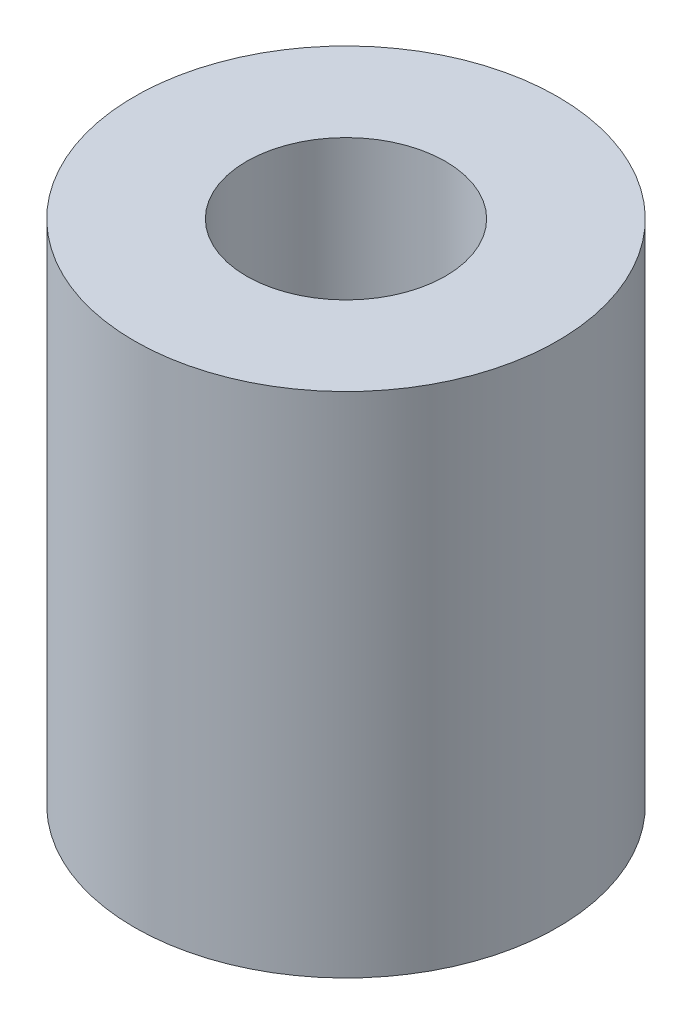
ISO-10303-21;
HEADER;
FILE_DESCRIPTION(('STEP AP214'),'2;1');
FILE_NAME('part.step','',(''),(''),'','','');
FILE_SCHEMA(('AUTOMOTIVE_DESIGN { 1 0 10303 214 1 1 1 1 }'));
ENDSEC;
DATA;
#1=APPLICATION_CONTEXT('core data for automotive mechanical design processes');
#2=APPLICATION_PROTOCOL_DEFINITION('international standard','automotive_design',2000,#1);
#3=PRODUCT_CONTEXT('',#1,'mechanical');
#4=PRODUCT('Part','Part','',(#3));
#5=PRODUCT_RELATED_PRODUCT_CATEGORY('part','',(#4));
#6=PRODUCT_DEFINITION_FORMATION('','',#4);
#7=PRODUCT_DEFINITION_CONTEXT('part definition',#1,'design');
#8=PRODUCT_DEFINITION('design','',#6,#7);
#9=PRODUCT_DEFINITION_SHAPE('','',#8);
#10=(LENGTH_UNIT() NAMED_UNIT(*) SI_UNIT(.MILLI.,.METRE.));
#11=(NAMED_UNIT(*) PLANE_ANGLE_UNIT() SI_UNIT($,.RADIAN.));
#12=(NAMED_UNIT(*) SI_UNIT($,.STERADIAN.) SOLID_ANGLE_UNIT());
#13=UNCERTAINTY_MEASURE_WITH_UNIT(LENGTH_MEASURE(1.E-05),#10,'distance_accuracy_value','');
#14=(GEOMETRIC_REPRESENTATION_CONTEXT(3) GLOBAL_UNCERTAINTY_ASSIGNED_CONTEXT((#13)) GLOBAL_UNIT_ASSIGNED_CONTEXT((#10,
#11,#12)) REPRESENTATION_CONTEXT('',''));
#15=CARTESIAN_POINT('',(0.,0.,0.));
#16=DIRECTION('',(0.,0.,1.));
#17=DIRECTION('',(1.,0.,0.));
#18=AXIS2_PLACEMENT_3D('',#15,#16,#17);
#19=CARTESIAN_POINT('',(0.,0.,0.));
#20=DIRECTION('',(0.,1.,0.));
#21=DIRECTION('',(0.,0.,1.));
#22=AXIS2_PLACEMENT_3D('',#19,#20,#21);
#23=PLANE('',#22);
#24=CARTESIAN_POINT('',(0.,0.,0.));
#25=DIRECTION('',(0.,1.,0.));
#26=DIRECTION('',(0.,0.,1.));
#27=AXIS2_PLACEMENT_3D('',#24,#25,#26);
#28=CIRCLE('',#27,5.);
#29=CARTESIAN_POINT('',(0.,0.,5.));
#30=VERTEX_POINT('',#29);
#31=EDGE_CURVE('E64',#30,#30,#28,.T.);
#32=ORIENTED_EDGE('',*,*,#31,.F.);
#33=EDGE_LOOP('',(#32));
#34=FACE_BOUND('',#33,.T.);
#35=ADVANCED_FACE('F60',(#34),#23,.F.);
#36=CARTESIAN_POINT('',(0.,12.,0.));
#37=DIRECTION('',(0.,-1.,0.));
#38=DIRECTION('',(0.,0.,-1.));
#39=AXIS2_PLACEMENT_3D('',#36,#37,#38);
#40=CYLINDRICAL_SURFACE('',#39,5.);
#41=CARTESIAN_POINT('',(0.,12.,0.));
#42=DIRECTION('',(0.,1.,0.));
#43=DIRECTION('',(0.,0.,1.));
#44=AXIS2_PLACEMENT_3D('',#41,#42,#43);
#45=CIRCLE('',#44,5.);
#46=CARTESIAN_POINT('',(0.,12.,5.));
#47=VERTEX_POINT('',#46);
#48=EDGE_CURVE('E11',#47,#47,#45,.T.);
#49=ORIENTED_EDGE('',*,*,#48,.F.);
#50=EDGE_LOOP('',(#49));
#51=FACE_BOUND('',#50,.T.);
#52=ORIENTED_EDGE('',*,*,#31,.T.);
#53=EDGE_LOOP('',(#52));
#54=FACE_BOUND('',#53,.T.);
#55=ADVANCED_FACE('F62',(#51,#54),#40,.T.);
#56=CARTESIAN_POINT('',(0.,12.,0.));
#57=DIRECTION('',(0.,1.,0.));
#58=DIRECTION('',(0.,0.,1.));
#59=AXIS2_PLACEMENT_3D('',#56,#57,#58);
#60=PLANE('',#59);
#61=CARTESIAN_POINT('',(0.,12.,0.));
#62=DIRECTION('',(0.,1.,0.));
#63=DIRECTION('',(0.,0.,1.));
#64=AXIS2_PLACEMENT_3D('',#61,#62,#63);
#65=CIRCLE('',#64,2.35);
#66=CARTESIAN_POINT('',(0.,12.,2.35));
#67=VERTEX_POINT('',#66);
#68=EDGE_CURVE('E73',#67,#67,#65,.T.);
#69=ORIENTED_EDGE('',*,*,#68,.F.);
#70=EDGE_LOOP('',(#69));
#71=FACE_BOUND('',#70,.T.);
#72=ORIENTED_EDGE('',*,*,#48,.T.);
#73=EDGE_LOOP('',(#72));
#74=FACE_BOUND('',#73,.T.);
#75=ADVANCED_FACE('F84',(#71,#74),#60,.T.);
#76=CARTESIAN_POINT('',(0.,3.,0.));
#77=DIRECTION('',(0.,1.,0.));
#78=DIRECTION('',(0.,0.,1.));
#79=AXIS2_PLACEMENT_3D('',#76,#77,#78);
#80=CYLINDRICAL_SURFACE('',#79,2.35);
#81=CARTESIAN_POINT('',(0.,3.,0.));
#82=DIRECTION('',(0.,1.,0.));
#83=DIRECTION('',(0.,0.,1.));
#84=AXIS2_PLACEMENT_3D('',#81,#82,#83);
#85=CIRCLE('',#84,2.35);
#86=CARTESIAN_POINT('',(0.,3.,2.35));
#87=VERTEX_POINT('',#86);
#88=EDGE_CURVE('E71',#87,#87,#85,.T.);
#89=ORIENTED_EDGE('',*,*,#88,.F.);
#90=EDGE_LOOP('',(#89));
#91=FACE_BOUND('',#90,.T.);
#92=ORIENTED_EDGE('',*,*,#68,.T.);
#93=EDGE_LOOP('',(#92));
#94=FACE_BOUND('',#93,.T.);
#95=ADVANCED_FACE('F81',(#91,#94),#80,.F.);
#96=CARTESIAN_POINT('',(0.,3.,0.));
#97=DIRECTION('',(0.,1.,0.));
#98=DIRECTION('',(0.,0.,1.));
#99=AXIS2_PLACEMENT_3D('',#96,#97,#98);
#100=PLANE('',#99);
#101=ORIENTED_EDGE('',*,*,#88,.T.);
#102=EDGE_LOOP('',(#101));
#103=FACE_BOUND('',#102,.T.);
#104=ADVANCED_FACE('F79',(#103),#100,.T.);
#105=CLOSED_SHELL('',(#35,#55,#75,#95,#104));
#106=MANIFOLD_SOLID_BREP('B2',#105);
#107=ADVANCED_BREP_SHAPE_REPRESENTATION('',(#18,#106),#14);
#108=SHAPE_DEFINITION_REPRESENTATION(#9,#107);
ENDSEC;
END-ISO-10303-21;
